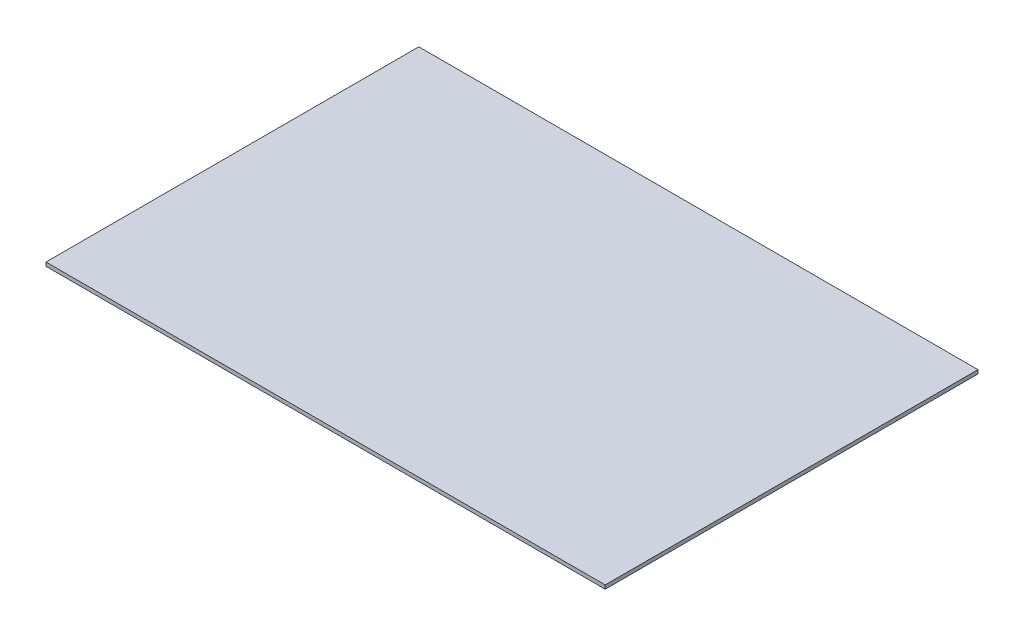
ISO-10303-21;
HEADER;
FILE_DESCRIPTION(('STEP AP214'),'2;1');
FILE_NAME('part.step','',(''),(''),'','','');
FILE_SCHEMA(('AUTOMOTIVE_DESIGN { 1 0 10303 214 1 1 1 1 }'));
ENDSEC;
DATA;
#1=APPLICATION_CONTEXT('core data for automotive mechanical design processes');
#2=APPLICATION_PROTOCOL_DEFINITION('international standard','automotive_design',2000,#1);
#3=PRODUCT_CONTEXT('',#1,'mechanical');
#4=PRODUCT('Part','Part','',(#3));
#5=PRODUCT_RELATED_PRODUCT_CATEGORY('part','',(#4));
#6=PRODUCT_DEFINITION_FORMATION('','',#4);
#7=PRODUCT_DEFINITION_CONTEXT('part definition',#1,'design');
#8=PRODUCT_DEFINITION('design','',#6,#7);
#9=PRODUCT_DEFINITION_SHAPE('','',#8);
#10=(LENGTH_UNIT() NAMED_UNIT(*) SI_UNIT(.MILLI.,.METRE.));
#11=(NAMED_UNIT(*) PLANE_ANGLE_UNIT() SI_UNIT($,.RADIAN.));
#12=(NAMED_UNIT(*) SI_UNIT($,.STERADIAN.) SOLID_ANGLE_UNIT());
#13=UNCERTAINTY_MEASURE_WITH_UNIT(LENGTH_MEASURE(1.E-05),#10,'distance_accuracy_value','');
#14=(GEOMETRIC_REPRESENTATION_CONTEXT(3) GLOBAL_UNCERTAINTY_ASSIGNED_CONTEXT((#13)) GLOBAL_UNIT_ASSIGNED_CONTEXT((#10,
#11,#12)) REPRESENTATION_CONTEXT('',''));
#15=CARTESIAN_POINT('',(0.,0.,0.));
#16=DIRECTION('',(0.,0.,1.));
#17=DIRECTION('',(1.,0.,0.));
#18=AXIS2_PLACEMENT_3D('',#15,#16,#17);
#19=CARTESIAN_POINT('',(0.,10.,0.));
#20=DIRECTION('',(-1.,0.,0.));
#21=DIRECTION('',(0.,0.,1.));
#22=AXIS2_PLACEMENT_3D('',#19,#20,#21);
#23=PLANE('',#22);
#24=DIRECTION('',(0.,0.,-1.));
#25=VECTOR('',#24,1.);
#26=CARTESIAN_POINT('',(0.,0.,0.));
#27=LINE('',#26,#25);
#28=CARTESIAN_POINT('',(0.,0.,0.));
#29=VERTEX_POINT('',#28);
#30=CARTESIAN_POINT('',(0.,0.,-1000.));
#31=VERTEX_POINT('',#30);
#32=EDGE_CURVE('E74',#29,#31,#27,.T.);
#33=ORIENTED_EDGE('',*,*,#32,.T.);
#34=DIRECTION('',(0.,-1.,0.));
#35=VECTOR('',#34,1.);
#36=CARTESIAN_POINT('',(0.,10.,-1000.));
#37=LINE('',#36,#35);
#38=CARTESIAN_POINT('',(0.,10.,-1000.));
#39=VERTEX_POINT('',#38);
#40=EDGE_CURVE('E11',#39,#31,#37,.T.);
#41=ORIENTED_EDGE('',*,*,#40,.F.);
#42=DIRECTION('',(0.,0.,-1.));
#43=VECTOR('',#42,1.);
#44=CARTESIAN_POINT('',(0.,10.,0.));
#45=LINE('',#44,#43);
#46=CARTESIAN_POINT('',(0.,10.,0.));
#47=VERTEX_POINT('',#46);
#48=EDGE_CURVE('E92',#47,#39,#45,.T.);
#49=ORIENTED_EDGE('',*,*,#48,.F.);
#50=DIRECTION('',(0.,-1.,0.));
#51=VECTOR('',#50,1.);
#52=CARTESIAN_POINT('',(0.,10.,0.));
#53=LINE('',#52,#51);
#54=EDGE_CURVE('E86',#47,#29,#53,.T.);
#55=ORIENTED_EDGE('',*,*,#54,.T.);
#56=EDGE_LOOP('',(#33,#41,#49,#55));
#57=FACE_BOUND('',#56,.T.);
#58=ADVANCED_FACE('F30',(#57),#23,.F.);
#59=CARTESIAN_POINT('',(0.,10.,-1000.));
#60=DIRECTION('',(0.,0.,1.));
#61=DIRECTION('',(1.,0.,0.));
#62=AXIS2_PLACEMENT_3D('',#59,#60,#61);
#63=PLANE('',#62);
#64=DIRECTION('',(-1.,0.,0.));
#65=VECTOR('',#64,1.);
#66=CARTESIAN_POINT('',(0.,0.,-1000.));
#67=LINE('',#66,#65);
#68=CARTESIAN_POINT('',(-1500.,0.,-1000.));
#69=VERTEX_POINT('',#68);
#70=EDGE_CURVE('E70',#31,#69,#67,.T.);
#71=ORIENTED_EDGE('',*,*,#70,.T.);
#72=DIRECTION('',(0.,-1.,0.));
#73=VECTOR('',#72,1.);
#74=CARTESIAN_POINT('',(-1500.,10.,-1000.));
#75=LINE('',#74,#73);
#76=CARTESIAN_POINT('',(-1500.,10.,-1000.));
#77=VERTEX_POINT('',#76);
#78=EDGE_CURVE('E37',#77,#69,#75,.T.);
#79=ORIENTED_EDGE('',*,*,#78,.F.);
#80=DIRECTION('',(-1.,0.,0.));
#81=VECTOR('',#80,1.);
#82=CARTESIAN_POINT('',(0.,10.,-1000.));
#83=LINE('',#82,#81);
#84=EDGE_CURVE('E82',#39,#77,#83,.T.);
#85=ORIENTED_EDGE('',*,*,#84,.F.);
#86=ORIENTED_EDGE('',*,*,#40,.T.);
#87=EDGE_LOOP('',(#71,#79,#85,#86));
#88=FACE_BOUND('',#87,.T.);
#89=ADVANCED_FACE('F81',(#88),#63,.F.);
#90=CARTESIAN_POINT('',(-1500.,10.,1.83690953073357E-13));
#91=DIRECTION('',(1.,0.,0.));
#92=DIRECTION('',(0.,0.,-1.));
#93=AXIS2_PLACEMENT_3D('',#90,#91,#92);
#94=PLANE('',#93);
#95=DIRECTION('',(0.,0.,1.));
#96=VECTOR('',#95,1.);
#97=CARTESIAN_POINT('',(-1500.,0.,1.83690953073357E-13));
#98=LINE('',#97,#96);
#99=CARTESIAN_POINT('',(-1500.,0.,1.83690953073357E-13));
#100=VERTEX_POINT('',#99);
#101=EDGE_CURVE('E75',#69,#100,#98,.T.);
#102=ORIENTED_EDGE('',*,*,#101,.T.);
#103=DIRECTION('',(0.,-1.,0.));
#104=VECTOR('',#103,1.);
#105=CARTESIAN_POINT('',(-1500.,10.,1.83690953073357E-13));
#106=LINE('',#105,#104);
#107=CARTESIAN_POINT('',(-1500.,10.,1.83690953073357E-13));
#108=VERTEX_POINT('',#107);
#109=EDGE_CURVE('E98',#108,#100,#106,.T.);
#110=ORIENTED_EDGE('',*,*,#109,.F.);
#111=DIRECTION('',(0.,0.,1.));
#112=VECTOR('',#111,1.);
#113=CARTESIAN_POINT('',(-1500.,10.,1.83690953073357E-13));
#114=LINE('',#113,#112);
#115=EDGE_CURVE('E49',#77,#108,#114,.T.);
#116=ORIENTED_EDGE('',*,*,#115,.F.);
#117=ORIENTED_EDGE('',*,*,#78,.T.);
#118=EDGE_LOOP('',(#102,#110,#116,#117));
#119=FACE_BOUND('',#118,.T.);
#120=ADVANCED_FACE('F101',(#119),#94,.F.);
#121=CARTESIAN_POINT('',(0.,10.,0.));
#122=DIRECTION('',(0.,0.,-1.));
#123=DIRECTION('',(-1.,0.,0.));
#124=AXIS2_PLACEMENT_3D('',#121,#122,#123);
#125=PLANE('',#124);
#126=DIRECTION('',(1.,0.,0.));
#127=VECTOR('',#126,1.);
#128=CARTESIAN_POINT('',(0.,0.,0.));
#129=LINE('',#128,#127);
#130=EDGE_CURVE('E90',#100,#29,#129,.T.);
#131=ORIENTED_EDGE('',*,*,#130,.T.);
#132=ORIENTED_EDGE('',*,*,#54,.F.);
#133=DIRECTION('',(1.,0.,0.));
#134=VECTOR('',#133,1.);
#135=CARTESIAN_POINT('',(0.,10.,0.));
#136=LINE('',#135,#134);
#137=EDGE_CURVE('E44',#108,#47,#136,.T.);
#138=ORIENTED_EDGE('',*,*,#137,.F.);
#139=ORIENTED_EDGE('',*,*,#109,.T.);
#140=EDGE_LOOP('',(#131,#132,#138,#139));
#141=FACE_BOUND('',#140,.T.);
#142=ADVANCED_FACE('F103',(#141),#125,.F.);
#143=CARTESIAN_POINT('',(0.,10.,0.));
#144=DIRECTION('',(0.,1.,0.));
#145=DIRECTION('',(0.,0.,1.));
#146=AXIS2_PLACEMENT_3D('',#143,#144,#145);
#147=PLANE('',#146);
#148=ORIENTED_EDGE('',*,*,#48,.T.);
#149=ORIENTED_EDGE('',*,*,#84,.T.);
#150=ORIENTED_EDGE('',*,*,#115,.T.);
#151=ORIENTED_EDGE('',*,*,#137,.T.);
#152=EDGE_LOOP('',(#148,#149,#150,#151));
#153=FACE_BOUND('',#152,.T.);
#154=ADVANCED_FACE('F104',(#153),#147,.T.);
#155=CARTESIAN_POINT('',(0.,0.,0.));
#156=DIRECTION('',(0.,1.,0.));
#157=DIRECTION('',(0.,0.,1.));
#158=AXIS2_PLACEMENT_3D('',#155,#156,#157);
#159=PLANE('',#158);
#160=ORIENTED_EDGE('',*,*,#32,.F.);
#161=ORIENTED_EDGE('',*,*,#130,.F.);
#162=ORIENTED_EDGE('',*,*,#101,.F.);
#163=ORIENTED_EDGE('',*,*,#70,.F.);
#164=EDGE_LOOP('',(#160,#161,#162,#163));
#165=FACE_BOUND('',#164,.T.);
#166=ADVANCED_FACE('F71',(#165),#159,.F.);
#167=CLOSED_SHELL('',(#58,#89,#120,#142,#154,#166));
#168=MANIFOLD_SOLID_BREP('B2',#167);
#169=ADVANCED_BREP_SHAPE_REPRESENTATION('',(#18,#168),#14);
#170=SHAPE_DEFINITION_REPRESENTATION(#9,#169);
ENDSEC;
END-ISO-10303-21;
